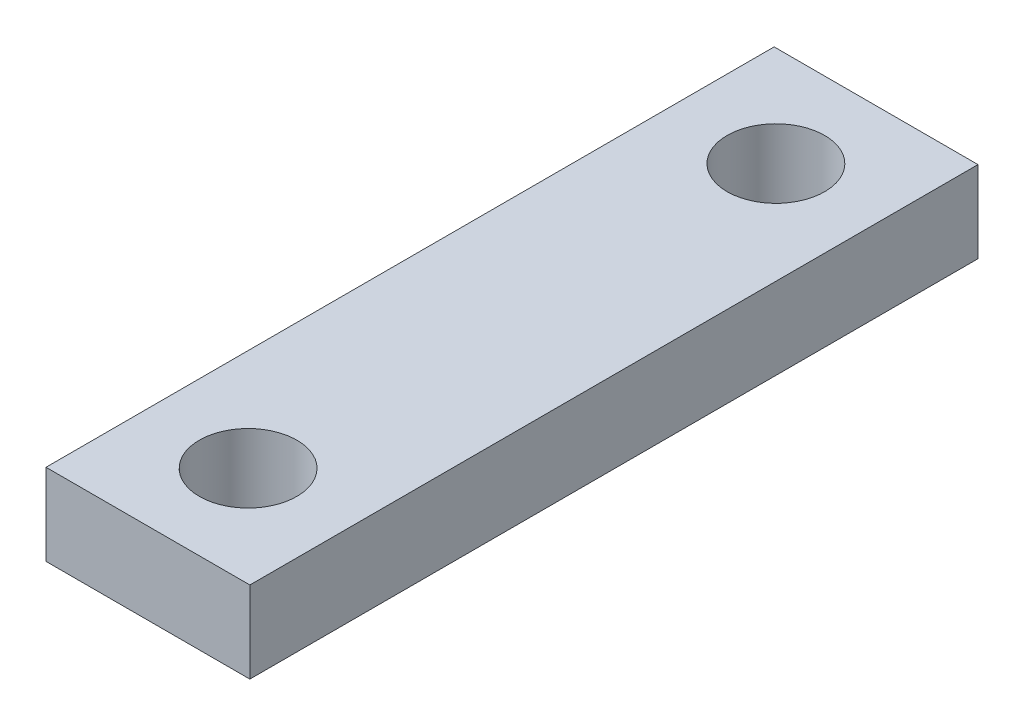
ISO-10303-21;
HEADER;
FILE_DESCRIPTION(('STEP AP214'),'2;1');
FILE_NAME('part.step','',(''),(''),'','','');
FILE_SCHEMA(('AUTOMOTIVE_DESIGN { 1 0 10303 214 1 1 1 1 }'));
ENDSEC;
DATA;
#1=APPLICATION_CONTEXT('core data for automotive mechanical design processes');
#2=APPLICATION_PROTOCOL_DEFINITION('international standard','automotive_design',2000,#1);
#3=PRODUCT_CONTEXT('',#1,'mechanical');
#4=PRODUCT('Part','Part','',(#3));
#5=PRODUCT_RELATED_PRODUCT_CATEGORY('part','',(#4));
#6=PRODUCT_DEFINITION_FORMATION('','',#4);
#7=PRODUCT_DEFINITION_CONTEXT('part definition',#1,'design');
#8=PRODUCT_DEFINITION('design','',#6,#7);
#9=PRODUCT_DEFINITION_SHAPE('','',#8);
#10=(LENGTH_UNIT() NAMED_UNIT(*) SI_UNIT(.MILLI.,.METRE.));
#11=(NAMED_UNIT(*) PLANE_ANGLE_UNIT() SI_UNIT($,.RADIAN.));
#12=(NAMED_UNIT(*) SI_UNIT($,.STERADIAN.) SOLID_ANGLE_UNIT());
#13=UNCERTAINTY_MEASURE_WITH_UNIT(LENGTH_MEASURE(1.E-05),#10,'distance_accuracy_value','');
#14=(GEOMETRIC_REPRESENTATION_CONTEXT(3) GLOBAL_UNCERTAINTY_ASSIGNED_CONTEXT((#13)) GLOBAL_UNIT_ASSIGNED_CONTEXT((#10,
#11,#12)) REPRESENTATION_CONTEXT('',''));
#15=CARTESIAN_POINT('',(0.,0.,0.));
#16=DIRECTION('',(0.,0.,1.));
#17=DIRECTION('',(1.,0.,0.));
#18=AXIS2_PLACEMENT_3D('',#15,#16,#17);
#19=CARTESIAN_POINT('',(0.,0.,28.35));
#20=DIRECTION('',(1.,0.,0.));
#21=DIRECTION('',(0.,0.,-1.));
#22=AXIS2_PLACEMENT_3D('',#19,#20,#21);
#23=PLANE('',#22);
#24=DIRECTION('',(0.,-1.,0.));
#25=VECTOR('',#24,1.);
#26=CARTESIAN_POINT('',(0.,0.,0.));
#27=LINE('',#26,#25);
#28=CARTESIAN_POINT('',(0.,3.175,0.));
#29=VERTEX_POINT('',#28);
#30=CARTESIAN_POINT('',(0.,0.,0.));
#31=VERTEX_POINT('',#30);
#32=EDGE_CURVE('E98',#29,#31,#27,.T.);
#33=ORIENTED_EDGE('',*,*,#32,.T.);
#34=DIRECTION('',(0.,0.,-1.));
#35=VECTOR('',#34,1.);
#36=CARTESIAN_POINT('',(0.,0.,28.35));
#37=LINE('',#36,#35);
#38=CARTESIAN_POINT('',(0.,0.,28.35));
#39=VERTEX_POINT('',#38);
#40=EDGE_CURVE('E11',#39,#31,#37,.T.);
#41=ORIENTED_EDGE('',*,*,#40,.F.);
#42=DIRECTION('',(0.,-1.,0.));
#43=VECTOR('',#42,1.);
#44=CARTESIAN_POINT('',(0.,0.,28.35));
#45=LINE('',#44,#43);
#46=CARTESIAN_POINT('',(0.,3.175,28.35));
#47=VERTEX_POINT('',#46);
#48=EDGE_CURVE('E86',#47,#39,#45,.T.);
#49=ORIENTED_EDGE('',*,*,#48,.F.);
#50=DIRECTION('',(0.,0.,-1.));
#51=VECTOR('',#50,1.);
#52=CARTESIAN_POINT('',(0.,3.175,28.35));
#53=LINE('',#52,#51);
#54=EDGE_CURVE('E94',#47,#29,#53,.T.);
#55=ORIENTED_EDGE('',*,*,#54,.T.);
#56=EDGE_LOOP('',(#33,#41,#49,#55));
#57=FACE_BOUND('',#56,.T.);
#58=ADVANCED_FACE('F35',(#57),#23,.F.);
#59=CARTESIAN_POINT('',(0.,0.,28.35));
#60=DIRECTION('',(0.,1.,0.));
#61=DIRECTION('',(0.,0.,1.));
#62=AXIS2_PLACEMENT_3D('',#59,#60,#61);
#63=PLANE('',#62);
#64=CARTESIAN_POINT('',(3.96875,0.,24.45));
#65=DIRECTION('',(0.,1.,0.));
#66=DIRECTION('',(0.,0.,1.));
#67=AXIS2_PLACEMENT_3D('',#64,#65,#66);
#68=CIRCLE('',#67,1.89865);
#69=CARTESIAN_POINT('',(3.96875,0.,26.34865));
#70=VERTEX_POINT('',#69);
#71=EDGE_CURVE('E115',#70,#70,#68,.T.);
#72=ORIENTED_EDGE('',*,*,#71,.T.);
#73=EDGE_LOOP('',(#72));
#74=FACE_BOUND('',#73,.T.);
#75=CARTESIAN_POINT('',(3.96875,0.,3.9));
#76=DIRECTION('',(0.,1.,0.));
#77=DIRECTION('',(0.,0.,1.));
#78=AXIS2_PLACEMENT_3D('',#75,#76,#77);
#79=CIRCLE('',#78,1.89865);
#80=CARTESIAN_POINT('',(3.96875,0.,5.79865));
#81=VERTEX_POINT('',#80);
#82=EDGE_CURVE('E101',#81,#81,#79,.T.);
#83=ORIENTED_EDGE('',*,*,#82,.T.);
#84=EDGE_LOOP('',(#83));
#85=FACE_BOUND('',#84,.T.);
#86=DIRECTION('',(1.,0.,0.));
#87=VECTOR('',#86,1.);
#88=CARTESIAN_POINT('',(0.,0.,0.));
#89=LINE('',#88,#87);
#90=CARTESIAN_POINT('',(7.9375,0.,0.));
#91=VERTEX_POINT('',#90);
#92=EDGE_CURVE('E90',#31,#91,#89,.T.);
#93=ORIENTED_EDGE('',*,*,#92,.T.);
#94=DIRECTION('',(0.,0.,-1.));
#95=VECTOR('',#94,1.);
#96=CARTESIAN_POINT('',(7.9375,0.,28.35));
#97=LINE('',#96,#95);
#98=CARTESIAN_POINT('',(7.9375,0.,28.35));
#99=VERTEX_POINT('',#98);
#100=EDGE_CURVE('E43',#99,#91,#97,.T.);
#101=ORIENTED_EDGE('',*,*,#100,.F.);
#102=DIRECTION('',(1.,0.,0.));
#103=VECTOR('',#102,1.);
#104=CARTESIAN_POINT('',(0.,0.,28.35));
#105=LINE('',#104,#103);
#106=EDGE_CURVE('E81',#39,#99,#105,.T.);
#107=ORIENTED_EDGE('',*,*,#106,.F.);
#108=ORIENTED_EDGE('',*,*,#40,.T.);
#109=EDGE_LOOP('',(#93,#101,#107,#108));
#110=FACE_BOUND('',#109,.T.);
#111=ADVANCED_FACE('F89',(#74,#85,#110),#63,.F.);
#112=CARTESIAN_POINT('',(7.9375,0.,28.35));
#113=DIRECTION('',(-1.,0.,0.));
#114=DIRECTION('',(0.,0.,1.));
#115=AXIS2_PLACEMENT_3D('',#112,#113,#114);
#116=PLANE('',#115);
#117=DIRECTION('',(0.,1.,0.));
#118=VECTOR('',#117,1.);
#119=CARTESIAN_POINT('',(7.9375,0.,0.));
#120=LINE('',#119,#118);
#121=CARTESIAN_POINT('',(7.9375,3.175,0.));
#122=VERTEX_POINT('',#121);
#123=EDGE_CURVE('E68',#91,#122,#120,.T.);
#124=ORIENTED_EDGE('',*,*,#123,.T.);
#125=DIRECTION('',(0.,0.,-1.));
#126=VECTOR('',#125,1.);
#127=CARTESIAN_POINT('',(7.9375,3.175,28.35));
#128=LINE('',#127,#126);
#129=CARTESIAN_POINT('',(7.9375,3.175,28.35));
#130=VERTEX_POINT('',#129);
#131=EDGE_CURVE('E91',#130,#122,#128,.T.);
#132=ORIENTED_EDGE('',*,*,#131,.F.);
#133=DIRECTION('',(0.,1.,0.));
#134=VECTOR('',#133,1.);
#135=CARTESIAN_POINT('',(7.9375,0.,28.35));
#136=LINE('',#135,#134);
#137=EDGE_CURVE('E84',#99,#130,#136,.T.);
#138=ORIENTED_EDGE('',*,*,#137,.F.);
#139=ORIENTED_EDGE('',*,*,#100,.T.);
#140=EDGE_LOOP('',(#124,#132,#138,#139));
#141=FACE_BOUND('',#140,.T.);
#142=ADVANCED_FACE('F92',(#141),#116,.F.);
#143=CARTESIAN_POINT('',(0.,3.175,28.35));
#144=DIRECTION('',(0.,-1.,0.));
#145=DIRECTION('',(0.,0.,-1.));
#146=AXIS2_PLACEMENT_3D('',#143,#144,#145);
#147=PLANE('',#146);
#148=CARTESIAN_POINT('',(3.96875,3.175,24.45));
#149=DIRECTION('',(0.,1.,0.));
#150=DIRECTION('',(0.,0.,1.));
#151=AXIS2_PLACEMENT_3D('',#148,#149,#150);
#152=CIRCLE('',#151,1.89865);
#153=CARTESIAN_POINT('',(3.96875,3.175,26.34865));
#154=VERTEX_POINT('',#153);
#155=EDGE_CURVE('E118',#154,#154,#152,.T.);
#156=ORIENTED_EDGE('',*,*,#155,.F.);
#157=EDGE_LOOP('',(#156));
#158=FACE_BOUND('',#157,.T.);
#159=CARTESIAN_POINT('',(3.96875,3.175,3.9));
#160=DIRECTION('',(0.,1.,0.));
#161=DIRECTION('',(0.,0.,1.));
#162=AXIS2_PLACEMENT_3D('',#159,#160,#161);
#163=CIRCLE('',#162,1.89865);
#164=CARTESIAN_POINT('',(3.96875,3.175,5.79865));
#165=VERTEX_POINT('',#164);
#166=EDGE_CURVE('E112',#165,#165,#163,.T.);
#167=ORIENTED_EDGE('',*,*,#166,.F.);
#168=EDGE_LOOP('',(#167));
#169=FACE_BOUND('',#168,.T.);
#170=DIRECTION('',(-1.,0.,0.));
#171=VECTOR('',#170,1.);
#172=CARTESIAN_POINT('',(0.,3.175,0.));
#173=LINE('',#172,#171);
#174=EDGE_CURVE('E74',#122,#29,#173,.T.);
#175=ORIENTED_EDGE('',*,*,#174,.T.);
#176=ORIENTED_EDGE('',*,*,#54,.F.);
#177=DIRECTION('',(-1.,0.,0.));
#178=VECTOR('',#177,1.);
#179=CARTESIAN_POINT('',(0.,3.175,28.35));
#180=LINE('',#179,#178);
#181=EDGE_CURVE('E51',#130,#47,#180,.T.);
#182=ORIENTED_EDGE('',*,*,#181,.F.);
#183=ORIENTED_EDGE('',*,*,#131,.T.);
#184=EDGE_LOOP('',(#175,#176,#182,#183));
#185=FACE_BOUND('',#184,.T.);
#186=ADVANCED_FACE('F106',(#158,#169,#185),#147,.F.);
#187=CARTESIAN_POINT('',(0.,0.,28.35));
#188=DIRECTION('',(0.,0.,-1.));
#189=DIRECTION('',(-1.,0.,0.));
#190=AXIS2_PLACEMENT_3D('',#187,#188,#189);
#191=PLANE('',#190);
#192=ORIENTED_EDGE('',*,*,#48,.T.);
#193=ORIENTED_EDGE('',*,*,#106,.T.);
#194=ORIENTED_EDGE('',*,*,#137,.T.);
#195=ORIENTED_EDGE('',*,*,#181,.T.);
#196=EDGE_LOOP('',(#192,#193,#194,#195));
#197=FACE_BOUND('',#196,.T.);
#198=ADVANCED_FACE('F82',(#197),#191,.F.);
#199=CARTESIAN_POINT('',(0.,0.,0.));
#200=DIRECTION('',(0.,0.,-1.));
#201=DIRECTION('',(-1.,0.,0.));
#202=AXIS2_PLACEMENT_3D('',#199,#200,#201);
#203=PLANE('',#202);
#204=ORIENTED_EDGE('',*,*,#32,.F.);
#205=ORIENTED_EDGE('',*,*,#174,.F.);
#206=ORIENTED_EDGE('',*,*,#123,.F.);
#207=ORIENTED_EDGE('',*,*,#92,.F.);
#208=EDGE_LOOP('',(#204,#205,#206,#207));
#209=FACE_BOUND('',#208,.T.);
#210=ADVANCED_FACE('F109',(#209),#203,.T.);
#211=CARTESIAN_POINT('',(3.96875,0.,3.9));
#212=DIRECTION('',(0.,1.,0.));
#213=DIRECTION('',(0.,0.,1.));
#214=AXIS2_PLACEMENT_3D('',#211,#212,#213);
#215=CYLINDRICAL_SURFACE('',#214,1.89865);
#216=ORIENTED_EDGE('',*,*,#82,.F.);
#217=EDGE_LOOP('',(#216));
#218=FACE_BOUND('',#217,.T.);
#219=ORIENTED_EDGE('',*,*,#166,.T.);
#220=EDGE_LOOP('',(#219));
#221=FACE_BOUND('',#220,.T.);
#222=ADVANCED_FACE('F129',(#218,#221),#215,.F.);
#223=CARTESIAN_POINT('',(3.96875,0.,24.45));
#224=DIRECTION('',(0.,1.,0.));
#225=DIRECTION('',(0.,0.,1.));
#226=AXIS2_PLACEMENT_3D('',#223,#224,#225);
#227=CYLINDRICAL_SURFACE('',#226,1.89865);
#228=ORIENTED_EDGE('',*,*,#71,.F.);
#229=EDGE_LOOP('',(#228));
#230=FACE_BOUND('',#229,.T.);
#231=ORIENTED_EDGE('',*,*,#155,.T.);
#232=EDGE_LOOP('',(#231));
#233=FACE_BOUND('',#232,.T.);
#234=ADVANCED_FACE('F126',(#230,#233),#227,.F.);
#235=CLOSED_SHELL('',(#58,#111,#142,#186,#198,#210,#222,#234));
#236=MANIFOLD_SOLID_BREP('B2',#235);
#237=ADVANCED_BREP_SHAPE_REPRESENTATION('',(#18,#236),#14);
#238=SHAPE_DEFINITION_REPRESENTATION(#9,#237);
ENDSEC;
END-ISO-10303-21;
